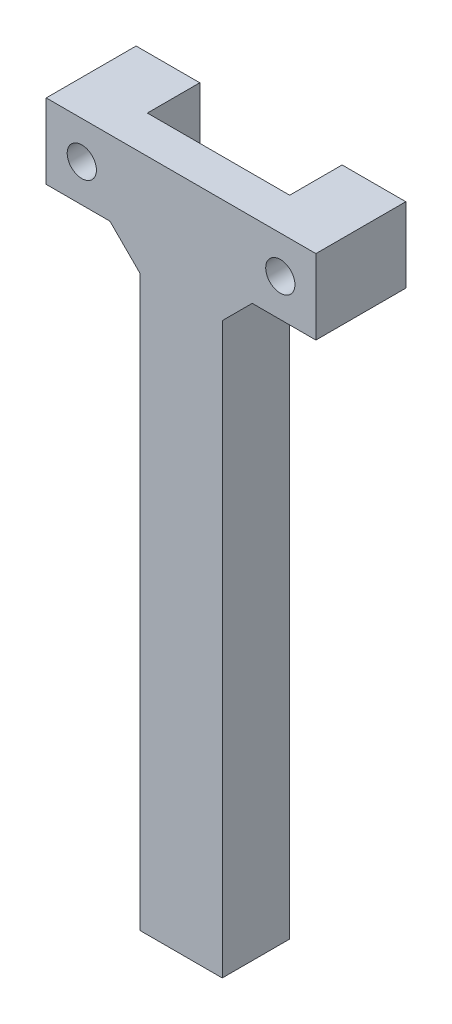
ISO-10303-21;
HEADER;
FILE_DESCRIPTION(('STEP AP214'),'2;1');
FILE_NAME('part.step','',(''),(''),'','','');
FILE_SCHEMA(('AUTOMOTIVE_DESIGN { 1 0 10303 214 1 1 1 1 }'));
ENDSEC;
DATA;
#1=APPLICATION_CONTEXT('core data for automotive mechanical design processes');
#2=APPLICATION_PROTOCOL_DEFINITION('international standard','automotive_design',2000,#1);
#3=PRODUCT_CONTEXT('',#1,'mechanical');
#4=PRODUCT('Part','Part','',(#3));
#5=PRODUCT_RELATED_PRODUCT_CATEGORY('part','',(#4));
#6=PRODUCT_DEFINITION_FORMATION('','',#4);
#7=PRODUCT_DEFINITION_CONTEXT('part definition',#1,'design');
#8=PRODUCT_DEFINITION('design','',#6,#7);
#9=PRODUCT_DEFINITION_SHAPE('','',#8);
#10=(LENGTH_UNIT() NAMED_UNIT(*) SI_UNIT(.MILLI.,.METRE.));
#11=(NAMED_UNIT(*) PLANE_ANGLE_UNIT() SI_UNIT($,.RADIAN.));
#12=(NAMED_UNIT(*) SI_UNIT($,.STERADIAN.) SOLID_ANGLE_UNIT());
#13=UNCERTAINTY_MEASURE_WITH_UNIT(LENGTH_MEASURE(1.E-05),#10,'distance_accuracy_value','');
#14=(GEOMETRIC_REPRESENTATION_CONTEXT(3) GLOBAL_UNCERTAINTY_ASSIGNED_CONTEXT((#13)) GLOBAL_UNIT_ASSIGNED_CONTEXT((#10,
#11,#12)) REPRESENTATION_CONTEXT('',''));
#15=CARTESIAN_POINT('',(0.,0.,0.));
#16=DIRECTION('',(0.,0.,1.));
#17=DIRECTION('',(1.,0.,0.));
#18=AXIS2_PLACEMENT_3D('',#15,#16,#17);
#19=CARTESIAN_POINT('',(9.5,10.,-3.));
#20=DIRECTION('',(0.,0.,1.));
#21=DIRECTION('',(1.,0.,0.));
#22=AXIS2_PLACEMENT_3D('',#19,#20,#21);
#23=PLANE('',#22);
#24=DIRECTION('',(-1.,0.,0.));
#25=VECTOR('',#24,1.);
#26=CARTESIAN_POINT('',(9.5,0.,-3.));
#27=LINE('',#26,#25);
#28=CARTESIAN_POINT('',(18.,0.,-3.));
#29=VERTEX_POINT('',#28);
#30=CARTESIAN_POINT('',(9.5,0.,-3.));
#31=VERTEX_POINT('',#30);
#32=EDGE_CURVE('E210',#29,#31,#27,.T.);
#33=ORIENTED_EDGE('',*,*,#32,.T.);
#34=DIRECTION('',(0.,-1.,0.));
#35=VECTOR('',#34,1.);
#36=CARTESIAN_POINT('',(9.5,10.,-3.));
#37=LINE('',#36,#35);
#38=CARTESIAN_POINT('',(9.5,10.,-3.));
#39=VERTEX_POINT('',#38);
#40=EDGE_CURVE('E228',#39,#31,#37,.T.);
#41=ORIENTED_EDGE('',*,*,#40,.F.);
#42=DIRECTION('',(-1.,0.,0.));
#43=VECTOR('',#42,1.);
#44=CARTESIAN_POINT('',(9.5,10.,-3.));
#45=LINE('',#44,#43);
#46=CARTESIAN_POINT('',(18.,10.,-3.));
#47=VERTEX_POINT('',#46);
#48=EDGE_CURVE('E191',#47,#39,#45,.T.);
#49=ORIENTED_EDGE('',*,*,#48,.F.);
#50=DIRECTION('',(0.,-1.,0.));
#51=VECTOR('',#50,1.);
#52=CARTESIAN_POINT('',(18.,10.,-3.));
#53=LINE('',#52,#51);
#54=EDGE_CURVE('E231',#47,#29,#53,.T.);
#55=ORIENTED_EDGE('',*,*,#54,.T.);
#56=EDGE_LOOP('',(#33,#41,#49,#55));
#57=FACE_BOUND('',#56,.T.);
#58=CARTESIAN_POINT('',(13.25,5.,-3.));
#59=DIRECTION('',(0.,0.,-1.));
#60=DIRECTION('',(-1.,0.,0.));
#61=AXIS2_PLACEMENT_3D('',#58,#59,#60);
#62=CIRCLE('',#61,1.94999999999999);
#63=CARTESIAN_POINT('',(11.3,5.,-3.));
#64=VERTEX_POINT('',#63);
#65=EDGE_CURVE('E163',#64,#64,#62,.T.);
#66=ORIENTED_EDGE('',*,*,#65,.F.);
#67=EDGE_LOOP('',(#66));
#68=FACE_BOUND('',#67,.T.);
#69=ADVANCED_FACE('F45',(#57,#68),#23,.F.);
#70=CARTESIAN_POINT('',(-5.5,-80.,0.));
#71=DIRECTION('',(-1.,0.,0.));
#72=DIRECTION('',(0.,0.,1.));
#73=AXIS2_PLACEMENT_3D('',#70,#71,#72);
#74=PLANE('',#73);
#75=DIRECTION('',(0.,1.,0.));
#76=VECTOR('',#75,1.);
#77=CARTESIAN_POINT('',(-5.5,-80.,4.));
#78=LINE('',#77,#76);
#79=CARTESIAN_POINT('',(-5.5,-3.99999999999998,4.));
#80=VERTEX_POINT('',#79);
#81=CARTESIAN_POINT('',(-5.5,0.,4.));
#82=VERTEX_POINT('',#81);
#83=EDGE_CURVE('E217',#80,#82,#78,.T.);
#84=ORIENTED_EDGE('',*,*,#83,.T.);
#85=DIRECTION('',(0.,0.707106781186549,0.707106781186546));
#86=VECTOR('',#85,1.);
#87=CARTESIAN_POINT('',(-5.5,-42.0000000000001,-38.));
#88=LINE('',#87,#86);
#89=CARTESIAN_POINT('',(-5.5,-4.00000000000003,0.));
#90=VERTEX_POINT('',#89);
#91=EDGE_CURVE('E271',#82,#90,#88,.F.);
#92=ORIENTED_EDGE('',*,*,#91,.T.);
#93=DIRECTION('',(0.,1.,0.));
#94=VECTOR('',#93,1.);
#95=CARTESIAN_POINT('',(-5.5,-80.,0.));
#96=LINE('',#95,#94);
#97=CARTESIAN_POINT('',(-5.5,-80.,0.));
#98=VERTEX_POINT('',#97);
#99=EDGE_CURVE('E218',#98,#90,#96,.T.);
#100=ORIENTED_EDGE('',*,*,#99,.F.);
#101=DIRECTION('',(0.,0.,1.));
#102=VECTOR('',#101,1.);
#103=CARTESIAN_POINT('',(-5.5,-80.,0.));
#104=LINE('',#103,#102);
#105=CARTESIAN_POINT('',(-5.5,-80.,9.));
#106=VERTEX_POINT('',#105);
#107=EDGE_CURVE('E243',#98,#106,#104,.T.);
#108=ORIENTED_EDGE('',*,*,#107,.T.);
#109=DIRECTION('',(0.,1.,0.));
#110=VECTOR('',#109,1.);
#111=CARTESIAN_POINT('',(-5.5,-80.,9.));
#112=LINE('',#111,#110);
#113=CARTESIAN_POINT('',(-5.5,-3.99999999999998,9.));
#114=VERTEX_POINT('',#113);
#115=EDGE_CURVE('E255',#106,#114,#112,.T.);
#116=ORIENTED_EDGE('',*,*,#115,.T.);
#117=DIRECTION('',(0.,0.,-1.));
#118=VECTOR('',#117,1.);
#119=CARTESIAN_POINT('',(-5.5,-3.99999999999998,4.));
#120=LINE('',#119,#118);
#121=EDGE_CURVE('E268',#114,#80,#120,.T.);
#122=ORIENTED_EDGE('',*,*,#121,.T.);
#123=EDGE_LOOP('',(#84,#92,#100,#108,#116,#122));
#124=FACE_BOUND('',#123,.T.);
#125=ADVANCED_FACE('F335',(#124),#74,.T.);
#126=CARTESIAN_POINT('',(-5.5,-80.,0.));
#127=DIRECTION('',(0.,0.,-1.));
#128=DIRECTION('',(-1.,0.,0.));
#129=AXIS2_PLACEMENT_3D('',#126,#127,#128);
#130=PLANE('',#129);
#131=ORIENTED_EDGE('',*,*,#99,.T.);
#132=DIRECTION('',(1.,0.,0.));
#133=VECTOR('',#132,1.);
#134=CARTESIAN_POINT('',(-5.5,-4.00000000000003,0.));
#135=LINE('',#134,#133);
#136=CARTESIAN_POINT('',(5.5,-4.00000000000003,0.));
#137=VERTEX_POINT('',#136);
#138=EDGE_CURVE('E273',#90,#137,#135,.T.);
#139=ORIENTED_EDGE('',*,*,#138,.T.);
#140=DIRECTION('',(0.,1.,0.));
#141=VECTOR('',#140,1.);
#142=CARTESIAN_POINT('',(5.5,-80.,0.));
#143=LINE('',#142,#141);
#144=CARTESIAN_POINT('',(5.5,-80.,0.));
#145=VERTEX_POINT('',#144);
#146=EDGE_CURVE('E258',#145,#137,#143,.T.);
#147=ORIENTED_EDGE('',*,*,#146,.F.);
#148=DIRECTION('',(-1.,0.,0.));
#149=VECTOR('',#148,1.);
#150=CARTESIAN_POINT('',(-5.5,-80.,0.));
#151=LINE('',#150,#149);
#152=EDGE_CURVE('E252',#145,#98,#151,.T.);
#153=ORIENTED_EDGE('',*,*,#152,.T.);
#154=EDGE_LOOP('',(#131,#139,#147,#153));
#155=FACE_BOUND('',#154,.T.);
#156=ADVANCED_FACE('F363',(#155),#130,.T.);
#157=CARTESIAN_POINT('',(5.5,-80.,0.));
#158=DIRECTION('',(1.,0.,0.));
#159=DIRECTION('',(0.,0.,-1.));
#160=AXIS2_PLACEMENT_3D('',#157,#158,#159);
#161=PLANE('',#160);
#162=ORIENTED_EDGE('',*,*,#146,.T.);
#163=DIRECTION('',(0.,-0.707106781186549,-0.707106781186546));
#164=VECTOR('',#163,1.);
#165=CARTESIAN_POINT('',(5.5,-42.0000000000001,-38.));
#166=LINE('',#165,#164);
#167=CARTESIAN_POINT('',(5.5,0.,4.));
#168=VERTEX_POINT('',#167);
#169=EDGE_CURVE('E278',#137,#168,#166,.F.);
#170=ORIENTED_EDGE('',*,*,#169,.T.);
#171=DIRECTION('',(0.,-1.,0.));
#172=VECTOR('',#171,1.);
#173=CARTESIAN_POINT('',(5.5,-80.,4.));
#174=LINE('',#173,#172);
#175=CARTESIAN_POINT('',(5.5,-3.99999999999998,4.));
#176=VERTEX_POINT('',#175);
#177=EDGE_CURVE('E61',#168,#176,#174,.T.);
#178=ORIENTED_EDGE('',*,*,#177,.T.);
#179=DIRECTION('',(0.,0.,1.));
#180=VECTOR('',#179,1.);
#181=CARTESIAN_POINT('',(5.5,-3.99999999999998,9.));
#182=LINE('',#181,#180);
#183=CARTESIAN_POINT('',(5.5,-3.99999999999998,9.));
#184=VERTEX_POINT('',#183);
#185=EDGE_CURVE('E275',#176,#184,#182,.T.);
#186=ORIENTED_EDGE('',*,*,#185,.T.);
#187=DIRECTION('',(0.,1.,0.));
#188=VECTOR('',#187,1.);
#189=CARTESIAN_POINT('',(5.5,-80.,9.));
#190=LINE('',#189,#188);
#191=CARTESIAN_POINT('',(5.5,-80.,9.));
#192=VERTEX_POINT('',#191);
#193=EDGE_CURVE('E261',#192,#184,#190,.T.);
#194=ORIENTED_EDGE('',*,*,#193,.F.);
#195=DIRECTION('',(0.,0.,-1.));
#196=VECTOR('',#195,1.);
#197=CARTESIAN_POINT('',(5.5,-80.,0.));
#198=LINE('',#197,#196);
#199=EDGE_CURVE('E249',#192,#145,#198,.T.);
#200=ORIENTED_EDGE('',*,*,#199,.T.);
#201=EDGE_LOOP('',(#162,#170,#178,#186,#194,#200));
#202=FACE_BOUND('',#201,.T.);
#203=ADVANCED_FACE('F296',(#202),#161,.T.);
#204=CARTESIAN_POINT('',(-5.5,-80.,9.));
#205=DIRECTION('',(0.,0.,1.));
#206=DIRECTION('',(1.,0.,0.));
#207=AXIS2_PLACEMENT_3D('',#204,#205,#206);
#208=PLANE('',#207);
#209=CARTESIAN_POINT('',(13.25,5.,9.));
#210=DIRECTION('',(0.,0.,1.));
#211=DIRECTION('',(1.,0.,0.));
#212=AXIS2_PLACEMENT_3D('',#209,#210,#211);
#213=CIRCLE('',#212,1.94999999999999);
#214=CARTESIAN_POINT('',(15.2,5.,9.));
#215=VERTEX_POINT('',#214);
#216=EDGE_CURVE('E167',#215,#215,#213,.T.);
#217=ORIENTED_EDGE('',*,*,#216,.F.);
#218=EDGE_LOOP('',(#217));
#219=FACE_BOUND('',#218,.T.);
#220=CARTESIAN_POINT('',(-13.25,5.,9.));
#221=DIRECTION('',(0.,0.,1.));
#222=DIRECTION('',(1.,0.,0.));
#223=AXIS2_PLACEMENT_3D('',#220,#221,#222);
#224=CIRCLE('',#223,1.94999999999999);
#225=CARTESIAN_POINT('',(-11.3,5.,9.));
#226=VERTEX_POINT('',#225);
#227=EDGE_CURVE('E177',#226,#226,#224,.T.);
#228=ORIENTED_EDGE('',*,*,#227,.F.);
#229=EDGE_LOOP('',(#228));
#230=FACE_BOUND('',#229,.T.);
#231=ORIENTED_EDGE('',*,*,#193,.T.);
#232=DIRECTION('',(-0.707106781186552,-0.707106781186543,0.));
#233=VECTOR('',#232,1.);
#234=CARTESIAN_POINT('',(9.50000000000003,0.,9.));
#235=LINE('',#234,#233);
#236=CARTESIAN_POINT('',(9.50000000000003,0.,9.));
#237=VERTEX_POINT('',#236);
#238=EDGE_CURVE('E11',#184,#237,#235,.F.);
#239=ORIENTED_EDGE('',*,*,#238,.T.);
#240=DIRECTION('',(1.,0.,0.));
#241=VECTOR('',#240,1.);
#242=CARTESIAN_POINT('',(18.,0.,9.));
#243=LINE('',#242,#241);
#244=CARTESIAN_POINT('',(18.,0.,9.));
#245=VERTEX_POINT('',#244);
#246=EDGE_CURVE('E204',#237,#245,#243,.T.);
#247=ORIENTED_EDGE('',*,*,#246,.T.);
#248=DIRECTION('',(0.,-1.,0.));
#249=VECTOR('',#248,1.);
#250=CARTESIAN_POINT('',(18.,10.,9.));
#251=LINE('',#250,#249);
#252=CARTESIAN_POINT('',(18.,10.,9.));
#253=VERTEX_POINT('',#252);
#254=EDGE_CURVE('E234',#253,#245,#251,.T.);
#255=ORIENTED_EDGE('',*,*,#254,.F.);
#256=DIRECTION('',(1.,0.,0.));
#257=VECTOR('',#256,1.);
#258=CARTESIAN_POINT('',(18.,10.,9.));
#259=LINE('',#258,#257);
#260=CARTESIAN_POINT('',(-18.,10.,9.00000000000001));
#261=VERTEX_POINT('',#260);
#262=EDGE_CURVE('E187',#261,#253,#259,.T.);
#263=ORIENTED_EDGE('',*,*,#262,.F.);
#264=DIRECTION('',(0.,-1.,0.));
#265=VECTOR('',#264,1.);
#266=CARTESIAN_POINT('',(-18.,10.,9.00000000000001));
#267=LINE('',#266,#265);
#268=CARTESIAN_POINT('',(-18.,0.,9.00000000000001));
#269=VERTEX_POINT('',#268);
#270=EDGE_CURVE('E237',#261,#269,#267,.T.);
#271=ORIENTED_EDGE('',*,*,#270,.T.);
#272=CARTESIAN_POINT('',(-9.50000000000003,0.,9.));
#273=VERTEX_POINT('',#272);
#274=EDGE_CURVE('E205',#269,#273,#243,.T.);
#275=ORIENTED_EDGE('',*,*,#274,.T.);
#276=DIRECTION('',(-0.707106781186552,0.707106781186543,0.));
#277=VECTOR('',#276,1.);
#278=CARTESIAN_POINT('',(-9.50000000000003,0.,9.));
#279=LINE('',#278,#277);
#280=EDGE_CURVE('E286',#273,#114,#279,.F.);
#281=ORIENTED_EDGE('',*,*,#280,.T.);
#282=ORIENTED_EDGE('',*,*,#115,.F.);
#283=DIRECTION('',(1.,0.,0.));
#284=VECTOR('',#283,1.);
#285=CARTESIAN_POINT('',(-5.5,-80.,9.));
#286=LINE('',#285,#284);
#287=EDGE_CURVE('E246',#106,#192,#286,.T.);
#288=ORIENTED_EDGE('',*,*,#287,.T.);
#289=EDGE_LOOP('',(#231,#239,#247,#255,#263,#271,#275,#281,#282,#288));
#290=FACE_BOUND('',#289,.T.);
#291=ADVANCED_FACE('F317',(#219,#230,#290),#208,.T.);
#292=CARTESIAN_POINT('',(0.,-80.,0.));
#293=DIRECTION('',(0.,1.,0.));
#294=DIRECTION('',(0.,0.,1.));
#295=AXIS2_PLACEMENT_3D('',#292,#293,#294);
#296=PLANE('',#295);
#297=CARTESIAN_POINT('',(0.,-80.,4.5));
#298=DIRECTION('',(0.,-1.,0.));
#299=DIRECTION('',(0.,0.,-1.));
#300=AXIS2_PLACEMENT_3D('',#297,#298,#299);
#301=CIRCLE('',#300,2.49999999999999);
#302=CARTESIAN_POINT('',(0.,-80.,2.00000000000001));
#303=VERTEX_POINT('',#302);
#304=EDGE_CURVE('E164',#303,#303,#301,.T.);
#305=ORIENTED_EDGE('',*,*,#304,.F.);
#306=EDGE_LOOP('',(#305));
#307=FACE_BOUND('',#306,.T.);
#308=ORIENTED_EDGE('',*,*,#107,.F.);
#309=ORIENTED_EDGE('',*,*,#152,.F.);
#310=ORIENTED_EDGE('',*,*,#199,.F.);
#311=ORIENTED_EDGE('',*,*,#287,.F.);
#312=EDGE_LOOP('',(#308,#309,#310,#311));
#313=FACE_BOUND('',#312,.T.);
#314=ADVANCED_FACE('F354',(#307,#313),#296,.F.);
#315=CARTESIAN_POINT('',(0.,0.,0.));
#316=DIRECTION('',(0.,-1.,0.));
#317=DIRECTION('',(0.,0.,-1.));
#318=AXIS2_PLACEMENT_3D('',#315,#316,#317);
#319=PLANE('',#318);
#320=DIRECTION('',(0.,0.,-1.));
#321=VECTOR('',#320,1.);
#322=CARTESIAN_POINT('',(-9.5,0.,-3.));
#323=LINE('',#322,#321);
#324=CARTESIAN_POINT('',(-9.5,0.,4.));
#325=VERTEX_POINT('',#324);
#326=CARTESIAN_POINT('',(-9.5,0.,-3.));
#327=VERTEX_POINT('',#326);
#328=EDGE_CURVE('E185',#325,#327,#323,.T.);
#329=ORIENTED_EDGE('',*,*,#328,.F.);
#330=DIRECTION('',(0.,0.,1.));
#331=VECTOR('',#330,1.);
#332=CARTESIAN_POINT('',(-9.50000000000003,0.,9.));
#333=LINE('',#332,#331);
#334=EDGE_CURVE('E280',#325,#273,#333,.T.);
#335=ORIENTED_EDGE('',*,*,#334,.T.);
#336=ORIENTED_EDGE('',*,*,#274,.F.);
#337=DIRECTION('',(0.,0.,1.));
#338=VECTOR('',#337,1.);
#339=CARTESIAN_POINT('',(-18.,0.,9.00000000000001));
#340=LINE('',#339,#338);
#341=CARTESIAN_POINT('',(-18.,0.,-3.));
#342=VERTEX_POINT('',#341);
#343=EDGE_CURVE('E202',#342,#269,#340,.T.);
#344=ORIENTED_EDGE('',*,*,#343,.F.);
#345=DIRECTION('',(-1.,0.,0.));
#346=VECTOR('',#345,1.);
#347=CARTESIAN_POINT('',(-18.,0.,-3.));
#348=LINE('',#347,#346);
#349=EDGE_CURVE('E180',#327,#342,#348,.T.);
#350=ORIENTED_EDGE('',*,*,#349,.F.);
#351=EDGE_LOOP('',(#329,#335,#336,#344,#350));
#352=FACE_BOUND('',#351,.T.);
#353=ADVANCED_FACE('F329',(#352),#319,.T.);
#354=CARTESIAN_POINT('',(-18.,10.,-3.));
#355=DIRECTION('',(0.,0.,1.));
#356=DIRECTION('',(1.,0.,0.));
#357=AXIS2_PLACEMENT_3D('',#354,#355,#356);
#358=PLANE('',#357);
#359=CARTESIAN_POINT('',(-13.25,5.,-3.));
#360=DIRECTION('',(0.,0.,-1.));
#361=DIRECTION('',(-1.,0.,0.));
#362=AXIS2_PLACEMENT_3D('',#359,#360,#361);
#363=CIRCLE('',#362,1.94999999999999);
#364=CARTESIAN_POINT('',(-15.2,5.,-3.));
#365=VERTEX_POINT('',#364);
#366=EDGE_CURVE('E174',#365,#365,#363,.T.);
#367=ORIENTED_EDGE('',*,*,#366,.F.);
#368=EDGE_LOOP('',(#367));
#369=FACE_BOUND('',#368,.T.);
#370=ORIENTED_EDGE('',*,*,#349,.T.);
#371=DIRECTION('',(0.,-1.,0.));
#372=VECTOR('',#371,1.);
#373=CARTESIAN_POINT('',(-18.,10.,-3.));
#374=LINE('',#373,#372);
#375=CARTESIAN_POINT('',(-18.,10.,-3.));
#376=VERTEX_POINT('',#375);
#377=EDGE_CURVE('E240',#376,#342,#374,.T.);
#378=ORIENTED_EDGE('',*,*,#377,.F.);
#379=DIRECTION('',(-1.,0.,0.));
#380=VECTOR('',#379,1.);
#381=CARTESIAN_POINT('',(-18.,10.,-3.));
#382=LINE('',#381,#380);
#383=CARTESIAN_POINT('',(-9.5,10.,-3.));
#384=VERTEX_POINT('',#383);
#385=EDGE_CURVE('E181',#384,#376,#382,.T.);
#386=ORIENTED_EDGE('',*,*,#385,.F.);
#387=DIRECTION('',(0.,-1.,0.));
#388=VECTOR('',#387,1.);
#389=CARTESIAN_POINT('',(-9.5,10.,-3.));
#390=LINE('',#389,#388);
#391=EDGE_CURVE('E199',#384,#327,#390,.T.);
#392=ORIENTED_EDGE('',*,*,#391,.T.);
#393=EDGE_LOOP('',(#370,#378,#386,#392));
#394=FACE_BOUND('',#393,.T.);
#395=ADVANCED_FACE('F345',(#369,#394),#358,.F.);
#396=CARTESIAN_POINT('',(-18.,10.,9.00000000000001));
#397=DIRECTION('',(1.,0.,0.));
#398=DIRECTION('',(0.,0.,-1.));
#399=AXIS2_PLACEMENT_3D('',#396,#397,#398);
#400=PLANE('',#399);
#401=ORIENTED_EDGE('',*,*,#343,.T.);
#402=ORIENTED_EDGE('',*,*,#270,.F.);
#403=DIRECTION('',(0.,0.,1.));
#404=VECTOR('',#403,1.);
#405=CARTESIAN_POINT('',(-18.,10.,9.00000000000001));
#406=LINE('',#405,#404);
#407=EDGE_CURVE('E184',#376,#261,#406,.T.);
#408=ORIENTED_EDGE('',*,*,#407,.F.);
#409=ORIENTED_EDGE('',*,*,#377,.T.);
#410=EDGE_LOOP('',(#401,#402,#408,#409));
#411=FACE_BOUND('',#410,.T.);
#412=ADVANCED_FACE('F325',(#411),#400,.F.);
#413=CARTESIAN_POINT('',(18.,10.,-3.));
#414=DIRECTION('',(-1.,0.,0.));
#415=DIRECTION('',(0.,0.,1.));
#416=AXIS2_PLACEMENT_3D('',#413,#414,#415);
#417=PLANE('',#416);
#418=DIRECTION('',(0.,0.,-1.));
#419=VECTOR('',#418,1.);
#420=CARTESIAN_POINT('',(18.,0.,-3.));
#421=LINE('',#420,#419);
#422=EDGE_CURVE('E208',#245,#29,#421,.T.);
#423=ORIENTED_EDGE('',*,*,#422,.T.);
#424=ORIENTED_EDGE('',*,*,#54,.F.);
#425=DIRECTION('',(0.,0.,-1.));
#426=VECTOR('',#425,1.);
#427=CARTESIAN_POINT('',(18.,10.,-3.));
#428=LINE('',#427,#426);
#429=EDGE_CURVE('E189',#253,#47,#428,.T.);
#430=ORIENTED_EDGE('',*,*,#429,.F.);
#431=ORIENTED_EDGE('',*,*,#254,.T.);
#432=EDGE_LOOP('',(#423,#424,#430,#431));
#433=FACE_BOUND('',#432,.T.);
#434=ADVANCED_FACE('F313',(#433),#417,.F.);
#435=CARTESIAN_POINT('',(9.5,10.,4.));
#436=DIRECTION('',(1.,0.,0.));
#437=DIRECTION('',(0.,0.,-1.));
#438=AXIS2_PLACEMENT_3D('',#435,#436,#437);
#439=PLANE('',#438);
#440=DIRECTION('',(0.,0.,1.));
#441=VECTOR('',#440,1.);
#442=CARTESIAN_POINT('',(9.5,0.,4.));
#443=LINE('',#442,#441);
#444=CARTESIAN_POINT('',(9.5,0.,4.));
#445=VERTEX_POINT('',#444);
#446=EDGE_CURVE('E212',#31,#445,#443,.T.);
#447=ORIENTED_EDGE('',*,*,#446,.T.);
#448=DIRECTION('',(0.,-1.,0.));
#449=VECTOR('',#448,1.);
#450=CARTESIAN_POINT('',(9.5,10.,4.));
#451=LINE('',#450,#449);
#452=CARTESIAN_POINT('',(9.5,10.,4.));
#453=VERTEX_POINT('',#452);
#454=EDGE_CURVE('E225',#453,#445,#451,.T.);
#455=ORIENTED_EDGE('',*,*,#454,.F.);
#456=DIRECTION('',(0.,0.,1.));
#457=VECTOR('',#456,1.);
#458=CARTESIAN_POINT('',(9.5,10.,4.));
#459=LINE('',#458,#457);
#460=EDGE_CURVE('E193',#39,#453,#459,.T.);
#461=ORIENTED_EDGE('',*,*,#460,.F.);
#462=ORIENTED_EDGE('',*,*,#40,.T.);
#463=EDGE_LOOP('',(#447,#455,#461,#462));
#464=FACE_BOUND('',#463,.T.);
#465=ADVANCED_FACE('F305',(#464),#439,.F.);
#466=CARTESIAN_POINT('',(-9.5,10.,4.));
#467=DIRECTION('',(0.,0.,1.));
#468=DIRECTION('',(1.,0.,0.));
#469=AXIS2_PLACEMENT_3D('',#466,#467,#468);
#470=PLANE('',#469);
#471=ORIENTED_EDGE('',*,*,#454,.T.);
#472=DIRECTION('',(0.707106781186552,0.707106781186543,0.));
#473=VECTOR('',#472,1.);
#474=CARTESIAN_POINT('',(4.99999999999988,-4.50000000000008,4.));
#475=LINE('',#474,#473);
#476=EDGE_CURVE('E54',#445,#176,#475,.F.);
#477=ORIENTED_EDGE('',*,*,#476,.T.);
#478=ORIENTED_EDGE('',*,*,#177,.F.);
#479=DIRECTION('',(-1.,0.,0.));
#480=VECTOR('',#479,1.);
#481=CARTESIAN_POINT('',(-9.5,0.,4.));
#482=LINE('',#481,#480);
#483=EDGE_CURVE('E215',#168,#82,#482,.T.);
#484=ORIENTED_EDGE('',*,*,#483,.T.);
#485=ORIENTED_EDGE('',*,*,#83,.F.);
#486=DIRECTION('',(0.707106781186552,-0.707106781186543,0.));
#487=VECTOR('',#486,1.);
#488=CARTESIAN_POINT('',(-14.5,4.99999999999991,4.));
#489=LINE('',#488,#487);
#490=EDGE_CURVE('E288',#80,#325,#489,.F.);
#491=ORIENTED_EDGE('',*,*,#490,.T.);
#492=DIRECTION('',(0.,-1.,0.));
#493=VECTOR('',#492,1.);
#494=CARTESIAN_POINT('',(-9.5,10.,4.));
#495=LINE('',#494,#493);
#496=CARTESIAN_POINT('',(-9.5,10.,4.));
#497=VERTEX_POINT('',#496);
#498=EDGE_CURVE('E222',#497,#325,#495,.T.);
#499=ORIENTED_EDGE('',*,*,#498,.F.);
#500=DIRECTION('',(-1.,0.,0.));
#501=VECTOR('',#500,1.);
#502=CARTESIAN_POINT('',(-9.5,10.,4.));
#503=LINE('',#502,#501);
#504=EDGE_CURVE('E195',#453,#497,#503,.T.);
#505=ORIENTED_EDGE('',*,*,#504,.F.);
#506=EDGE_LOOP('',(#471,#477,#478,#484,#485,#491,#499,#505));
#507=FACE_BOUND('',#506,.T.);
#508=ADVANCED_FACE('F289',(#507),#470,.F.);
#509=CARTESIAN_POINT('',(-9.5,10.,-3.));
#510=DIRECTION('',(-1.,0.,0.));
#511=DIRECTION('',(0.,0.,1.));
#512=AXIS2_PLACEMENT_3D('',#509,#510,#511);
#513=PLANE('',#512);
#514=ORIENTED_EDGE('',*,*,#328,.T.);
#515=ORIENTED_EDGE('',*,*,#391,.F.);
#516=DIRECTION('',(0.,0.,-1.));
#517=VECTOR('',#516,1.);
#518=CARTESIAN_POINT('',(-9.5,10.,-3.));
#519=LINE('',#518,#517);
#520=EDGE_CURVE('E197',#497,#384,#519,.T.);
#521=ORIENTED_EDGE('',*,*,#520,.F.);
#522=ORIENTED_EDGE('',*,*,#498,.T.);
#523=EDGE_LOOP('',(#514,#515,#521,#522));
#524=FACE_BOUND('',#523,.T.);
#525=ADVANCED_FACE('F342',(#524),#513,.F.);
#526=CARTESIAN_POINT('',(0.,10.,0.));
#527=DIRECTION('',(0.,-1.,0.));
#528=DIRECTION('',(0.,0.,-1.));
#529=AXIS2_PLACEMENT_3D('',#526,#527,#528);
#530=PLANE('',#529);
#531=ORIENTED_EDGE('',*,*,#385,.T.);
#532=ORIENTED_EDGE('',*,*,#407,.T.);
#533=ORIENTED_EDGE('',*,*,#262,.T.);
#534=ORIENTED_EDGE('',*,*,#429,.T.);
#535=ORIENTED_EDGE('',*,*,#48,.T.);
#536=ORIENTED_EDGE('',*,*,#460,.T.);
#537=ORIENTED_EDGE('',*,*,#504,.T.);
#538=ORIENTED_EDGE('',*,*,#520,.T.);
#539=EDGE_LOOP('',(#531,#532,#533,#534,#535,#536,#537,#538));
#540=FACE_BOUND('',#539,.T.);
#541=ADVANCED_FACE('F321',(#540),#530,.F.);
#542=ORIENTED_EDGE('',*,*,#246,.F.);
#543=DIRECTION('',(0.,0.,-1.));
#544=VECTOR('',#543,1.);
#545=CARTESIAN_POINT('',(9.50000000000003,0.,4.));
#546=LINE('',#545,#544);
#547=EDGE_CURVE('E283',#237,#445,#546,.T.);
#548=ORIENTED_EDGE('',*,*,#547,.T.);
#549=ORIENTED_EDGE('',*,*,#446,.F.);
#550=ORIENTED_EDGE('',*,*,#32,.F.);
#551=ORIENTED_EDGE('',*,*,#422,.F.);
#552=EDGE_LOOP('',(#542,#548,#549,#550,#551));
#553=FACE_BOUND('',#552,.T.);
#554=ADVANCED_FACE('F301',(#553),#319,.T.);
#555=CARTESIAN_POINT('',(-13.25,5.,-3.));
#556=DIRECTION('',(0.,0.,-1.));
#557=DIRECTION('',(-1.,0.,0.));
#558=AXIS2_PLACEMENT_3D('',#555,#556,#557);
#559=CYLINDRICAL_SURFACE('',#558,1.94999999999999);
#560=ORIENTED_EDGE('',*,*,#366,.T.);
#561=EDGE_LOOP('',(#560));
#562=FACE_BOUND('',#561,.T.);
#563=ORIENTED_EDGE('',*,*,#227,.T.);
#564=EDGE_LOOP('',(#563));
#565=FACE_BOUND('',#564,.T.);
#566=ADVANCED_FACE('F381',(#562,#565),#559,.F.);
#567=CARTESIAN_POINT('',(13.25,5.,-3.));
#568=DIRECTION('',(0.,0.,-1.));
#569=DIRECTION('',(-1.,0.,0.));
#570=AXIS2_PLACEMENT_3D('',#567,#568,#569);
#571=CYLINDRICAL_SURFACE('',#570,1.94999999999999);
#572=ORIENTED_EDGE('',*,*,#65,.T.);
#573=EDGE_LOOP('',(#572));
#574=FACE_BOUND('',#573,.T.);
#575=ORIENTED_EDGE('',*,*,#216,.T.);
#576=EDGE_LOOP('',(#575));
#577=FACE_BOUND('',#576,.T.);
#578=ADVANCED_FACE('F386',(#574,#577),#571,.F.);
#579=CARTESIAN_POINT('',(0.,0.,4.00000000000002));
#580=DIRECTION('',(0.,-0.707106781186546,0.707106781186549));
#581=DIRECTION('',(-1.,0.,0.));
#582=AXIS2_PLACEMENT_3D('',#579,#580,#581);
#583=PLANE('',#582);
#584=ORIENTED_EDGE('',*,*,#169,.F.);
#585=ORIENTED_EDGE('',*,*,#138,.F.);
#586=ORIENTED_EDGE('',*,*,#91,.F.);
#587=ORIENTED_EDGE('',*,*,#483,.F.);
#588=EDGE_LOOP('',(#584,#585,#586,#587));
#589=FACE_BOUND('',#588,.T.);
#590=ADVANCED_FACE('F389',(#589),#583,.F.);
#591=CARTESIAN_POINT('',(-9.50000000000003,0.,0.));
#592=DIRECTION('',(-0.707106781186543,-0.707106781186552,0.));
#593=DIRECTION('',(0.,0.,-1.));
#594=AXIS2_PLACEMENT_3D('',#591,#592,#593);
#595=PLANE('',#594);
#596=ORIENTED_EDGE('',*,*,#490,.F.);
#597=ORIENTED_EDGE('',*,*,#121,.F.);
#598=ORIENTED_EDGE('',*,*,#280,.F.);
#599=ORIENTED_EDGE('',*,*,#334,.F.);
#600=EDGE_LOOP('',(#596,#597,#598,#599));
#601=FACE_BOUND('',#600,.T.);
#602=ADVANCED_FACE('F338',(#601),#595,.T.);
#603=CARTESIAN_POINT('',(9.50000000000003,0.,0.));
#604=DIRECTION('',(0.707106781186543,-0.707106781186552,0.));
#605=DIRECTION('',(0.,0.,1.));
#606=AXIS2_PLACEMENT_3D('',#603,#604,#605);
#607=PLANE('',#606);
#608=ORIENTED_EDGE('',*,*,#238,.F.);
#609=ORIENTED_EDGE('',*,*,#185,.F.);
#610=ORIENTED_EDGE('',*,*,#476,.F.);
#611=ORIENTED_EDGE('',*,*,#547,.F.);
#612=EDGE_LOOP('',(#608,#609,#610,#611));
#613=FACE_BOUND('',#612,.T.);
#614=ADVANCED_FACE('F48',(#613),#607,.T.);
#615=CARTESIAN_POINT('',(0.,-65.,4.5));
#616=DIRECTION('',(0.,-1.,0.));
#617=DIRECTION('',(0.,0.,-1.));
#618=AXIS2_PLACEMENT_3D('',#615,#616,#617);
#619=CONICAL_SURFACE('',#618,2.49999999999999,1.02974425867665);
#620=CARTESIAN_POINT('',(0.,-63.4978484524311,4.5));
#621=VERTEX_POINT('',#620);
#622=VERTEX_LOOP('',#621);
#623=FACE_BOUND('',#622,.T.);
#624=CARTESIAN_POINT('',(0.,-65.,4.5));
#625=DIRECTION('',(0.,-1.,0.));
#626=DIRECTION('',(0.,0.,-1.));
#627=AXIS2_PLACEMENT_3D('',#624,#625,#626);
#628=CIRCLE('',#627,2.49999999999999);
#629=CARTESIAN_POINT('',(0.,-65.,2.00000000000001));
#630=VERTEX_POINT('',#629);
#631=EDGE_CURVE('E161',#630,#630,#628,.T.);
#632=ORIENTED_EDGE('',*,*,#631,.T.);
#633=EDGE_LOOP('',(#632));
#634=FACE_BOUND('',#633,.T.);
#635=ADVANCED_FACE('F154',(#623,#634),#619,.F.);
#636=CARTESIAN_POINT('',(0.,-80.,4.5));
#637=DIRECTION('',(0.,-1.,0.));
#638=DIRECTION('',(0.,0.,-1.));
#639=AXIS2_PLACEMENT_3D('',#636,#637,#638);
#640=CYLINDRICAL_SURFACE('',#639,2.49999999999999);
#641=ORIENTED_EDGE('',*,*,#631,.F.);
#642=EDGE_LOOP('',(#641));
#643=FACE_BOUND('',#642,.T.);
#644=ORIENTED_EDGE('',*,*,#304,.T.);
#645=EDGE_LOOP('',(#644));
#646=FACE_BOUND('',#645,.T.);
#647=ADVANCED_FACE('F157',(#643,#646),#640,.F.);
#648=CLOSED_SHELL('',(#69,#125,#156,#203,#291,#314,#353,#395,#412,#434,#465,#508,#525,#541,#554,
#566,#578,#590,#602,#614,#635,#647));
#649=MANIFOLD_SOLID_BREP('B2',#648);
#650=ADVANCED_BREP_SHAPE_REPRESENTATION('',(#18,#649),#14);
#651=SHAPE_DEFINITION_REPRESENTATION(#9,#650);
ENDSEC;
END-ISO-10303-21;
